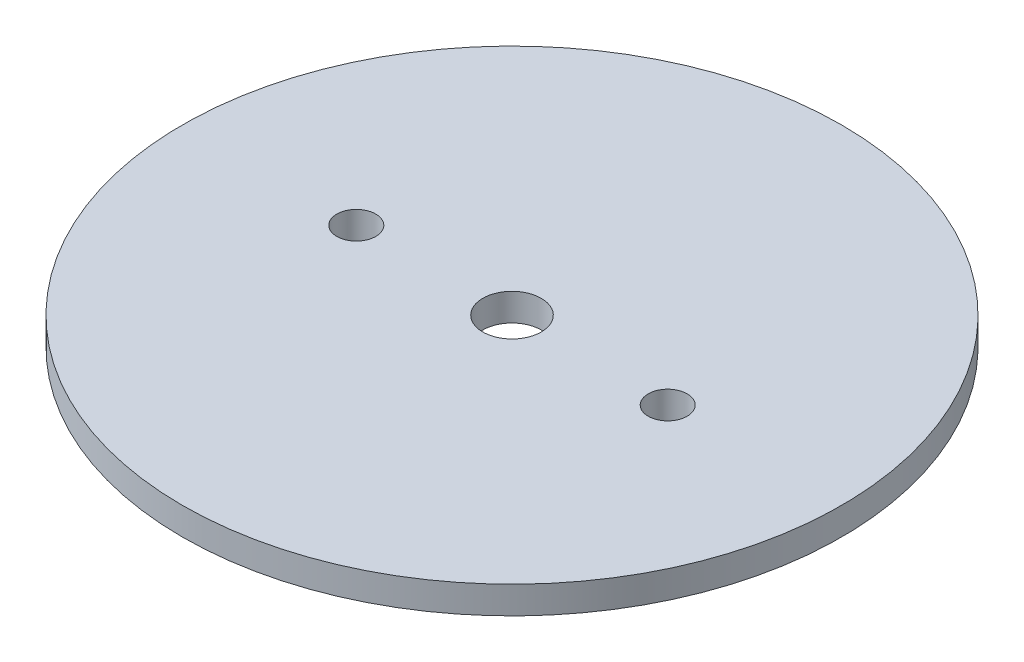
ISO-10303-21;
HEADER;
FILE_DESCRIPTION(('STEP AP214'),'2;1');
FILE_NAME('part.step','',(''),(''),'','','');
FILE_SCHEMA(('AUTOMOTIVE_DESIGN { 1 0 10303 214 1 1 1 1 }'));
ENDSEC;
DATA;
#1=APPLICATION_CONTEXT('core data for automotive mechanical design processes');
#2=APPLICATION_PROTOCOL_DEFINITION('international standard','automotive_design',2000,#1);
#3=PRODUCT_CONTEXT('',#1,'mechanical');
#4=PRODUCT('Part','Part','',(#3));
#5=PRODUCT_RELATED_PRODUCT_CATEGORY('part','',(#4));
#6=PRODUCT_DEFINITION_FORMATION('','',#4);
#7=PRODUCT_DEFINITION_CONTEXT('part definition',#1,'design');
#8=PRODUCT_DEFINITION('design','',#6,#7);
#9=PRODUCT_DEFINITION_SHAPE('','',#8);
#10=(LENGTH_UNIT() NAMED_UNIT(*) SI_UNIT(.MILLI.,.METRE.));
#11=(NAMED_UNIT(*) PLANE_ANGLE_UNIT() SI_UNIT($,.RADIAN.));
#12=(NAMED_UNIT(*) SI_UNIT($,.STERADIAN.) SOLID_ANGLE_UNIT());
#13=UNCERTAINTY_MEASURE_WITH_UNIT(LENGTH_MEASURE(1.E-05),#10,'distance_accuracy_value','');
#14=(GEOMETRIC_REPRESENTATION_CONTEXT(3) GLOBAL_UNCERTAINTY_ASSIGNED_CONTEXT((#13)) GLOBAL_UNIT_ASSIGNED_CONTEXT((#10,
#11,#12)) REPRESENTATION_CONTEXT('',''));
#15=CARTESIAN_POINT('',(0.,0.,0.));
#16=DIRECTION('',(0.,0.,1.));
#17=DIRECTION('',(1.,0.,0.));
#18=AXIS2_PLACEMENT_3D('',#15,#16,#17);
#19=CARTESIAN_POINT('',(0.,1.5875,0.));
#20=DIRECTION('',(0.,-1.,0.));
#21=DIRECTION('',(0.,0.,-1.));
#22=AXIS2_PLACEMENT_3D('',#19,#20,#21);
#23=CYLINDRICAL_SURFACE('',#22,38.1);
#24=CARTESIAN_POINT('',(0.,1.5875,0.));
#25=DIRECTION('',(0.,1.,0.));
#26=DIRECTION('',(0.,0.,1.));
#27=AXIS2_PLACEMENT_3D('',#24,#25,#26);
#28=CIRCLE('',#27,38.1);
#29=CARTESIAN_POINT('',(0.,1.5875,38.1));
#30=VERTEX_POINT('',#29);
#31=EDGE_CURVE('E10',#30,#30,#28,.T.);
#32=ORIENTED_EDGE('',*,*,#31,.F.);
#33=EDGE_LOOP('',(#32));
#34=FACE_BOUND('',#33,.T.);
#35=CARTESIAN_POINT('',(0.,-1.5875,0.));
#36=DIRECTION('',(0.,1.,0.));
#37=DIRECTION('',(0.,0.,1.));
#38=AXIS2_PLACEMENT_3D('',#35,#36,#37);
#39=CIRCLE('',#38,38.1);
#40=CARTESIAN_POINT('',(0.,-1.5875,38.1));
#41=VERTEX_POINT('',#40);
#42=EDGE_CURVE('E44',#41,#41,#39,.T.);
#43=ORIENTED_EDGE('',*,*,#42,.T.);
#44=EDGE_LOOP('',(#43));
#45=FACE_BOUND('',#44,.T.);
#46=ADVANCED_FACE('F41',(#34,#45),#23,.T.);
#47=CARTESIAN_POINT('',(0.,1.5875,0.));
#48=DIRECTION('',(0.,1.,0.));
#49=DIRECTION('',(0.,0.,1.));
#50=AXIS2_PLACEMENT_3D('',#47,#48,#49);
#51=PLANE('',#50);
#52=CARTESIAN_POINT('',(0.,1.58750000000001,0.));
#53=DIRECTION('',(0.,-1.,0.));
#54=DIRECTION('',(0.,0.,-1.));
#55=AXIS2_PLACEMENT_3D('',#52,#53,#54);
#56=CIRCLE('',#55,3.3782);
#57=CARTESIAN_POINT('',(0.,1.58750000000001,-3.3782));
#58=VERTEX_POINT('',#57);
#59=EDGE_CURVE('E70',#58,#58,#56,.T.);
#60=ORIENTED_EDGE('',*,*,#59,.T.);
#61=EDGE_LOOP('',(#60));
#62=FACE_BOUND('',#61,.T.);
#63=CARTESIAN_POINT('',(18.,1.58750000000001,0.));
#64=DIRECTION('',(0.,-1.,0.));
#65=DIRECTION('',(0.,0.,-1.));
#66=AXIS2_PLACEMENT_3D('',#63,#64,#65);
#67=CIRCLE('',#66,2.24999999999998);
#68=CARTESIAN_POINT('',(18.,1.58750000000001,-2.24999999999998));
#69=VERTEX_POINT('',#68);
#70=EDGE_CURVE('E62',#69,#69,#67,.T.);
#71=ORIENTED_EDGE('',*,*,#70,.T.);
#72=EDGE_LOOP('',(#71));
#73=FACE_BOUND('',#72,.T.);
#74=CARTESIAN_POINT('',(-18.,1.58750000000001,0.));
#75=DIRECTION('',(0.,-1.,0.));
#76=DIRECTION('',(0.,0.,-1.));
#77=AXIS2_PLACEMENT_3D('',#74,#75,#76);
#78=CIRCLE('',#77,2.24999999999998);
#79=CARTESIAN_POINT('',(-18.,1.58750000000001,-2.24999999999998));
#80=VERTEX_POINT('',#79);
#81=EDGE_CURVE('E53',#80,#80,#78,.T.);
#82=ORIENTED_EDGE('',*,*,#81,.T.);
#83=EDGE_LOOP('',(#82));
#84=FACE_BOUND('',#83,.T.);
#85=ORIENTED_EDGE('',*,*,#31,.T.);
#86=EDGE_LOOP('',(#85));
#87=FACE_BOUND('',#86,.T.);
#88=ADVANCED_FACE('F79',(#62,#73,#84,#87),#51,.T.);
#89=CARTESIAN_POINT('',(0.,-1.5875,0.));
#90=DIRECTION('',(0.,1.,0.));
#91=DIRECTION('',(0.,0.,1.));
#92=AXIS2_PLACEMENT_3D('',#89,#90,#91);
#93=PLANE('',#92);
#94=CARTESIAN_POINT('',(0.,-1.5875,0.));
#95=DIRECTION('',(0.,-1.,0.));
#96=DIRECTION('',(0.,0.,-1.));
#97=AXIS2_PLACEMENT_3D('',#94,#95,#96);
#98=CIRCLE('',#97,3.3782);
#99=CARTESIAN_POINT('',(0.,-1.5875,-3.3782));
#100=VERTEX_POINT('',#99);
#101=EDGE_CURVE('E71',#100,#100,#98,.T.);
#102=ORIENTED_EDGE('',*,*,#101,.F.);
#103=EDGE_LOOP('',(#102));
#104=FACE_BOUND('',#103,.T.);
#105=CARTESIAN_POINT('',(18.,-1.5875,0.));
#106=DIRECTION('',(0.,-1.,0.));
#107=DIRECTION('',(0.,0.,-1.));
#108=AXIS2_PLACEMENT_3D('',#105,#106,#107);
#109=CIRCLE('',#108,2.24999999999998);
#110=CARTESIAN_POINT('',(18.,-1.5875,-2.24999999999998));
#111=VERTEX_POINT('',#110);
#112=EDGE_CURVE('E66',#111,#111,#109,.T.);
#113=ORIENTED_EDGE('',*,*,#112,.F.);
#114=EDGE_LOOP('',(#113));
#115=FACE_BOUND('',#114,.T.);
#116=CARTESIAN_POINT('',(-18.,-1.5875,0.));
#117=DIRECTION('',(0.,-1.,0.));
#118=DIRECTION('',(0.,0.,-1.));
#119=AXIS2_PLACEMENT_3D('',#116,#117,#118);
#120=CIRCLE('',#119,2.24999999999998);
#121=CARTESIAN_POINT('',(-18.,-1.5875,-2.24999999999998));
#122=VERTEX_POINT('',#121);
#123=EDGE_CURVE('E58',#122,#122,#120,.T.);
#124=ORIENTED_EDGE('',*,*,#123,.F.);
#125=EDGE_LOOP('',(#124));
#126=FACE_BOUND('',#125,.T.);
#127=ORIENTED_EDGE('',*,*,#42,.F.);
#128=EDGE_LOOP('',(#127));
#129=FACE_BOUND('',#128,.T.);
#130=ADVANCED_FACE('F89',(#104,#115,#126,#129),#93,.F.);
#131=CARTESIAN_POINT('',(-18.,-1.5875,0.));
#132=DIRECTION('',(0.,-1.,0.));
#133=DIRECTION('',(0.,0.,-1.));
#134=AXIS2_PLACEMENT_3D('',#131,#132,#133);
#135=CYLINDRICAL_SURFACE('',#134,2.24999999999998);
#136=ORIENTED_EDGE('',*,*,#81,.F.);
#137=EDGE_LOOP('',(#136));
#138=FACE_BOUND('',#137,.T.);
#139=ORIENTED_EDGE('',*,*,#123,.T.);
#140=EDGE_LOOP('',(#139));
#141=FACE_BOUND('',#140,.T.);
#142=ADVANCED_FACE('F92',(#138,#141),#135,.F.);
#143=CARTESIAN_POINT('',(18.,-1.5875,0.));
#144=DIRECTION('',(0.,-1.,0.));
#145=DIRECTION('',(0.,0.,-1.));
#146=AXIS2_PLACEMENT_3D('',#143,#144,#145);
#147=CYLINDRICAL_SURFACE('',#146,2.24999999999998);
#148=ORIENTED_EDGE('',*,*,#70,.F.);
#149=EDGE_LOOP('',(#148));
#150=FACE_BOUND('',#149,.T.);
#151=ORIENTED_EDGE('',*,*,#112,.T.);
#152=EDGE_LOOP('',(#151));
#153=FACE_BOUND('',#152,.T.);
#154=ADVANCED_FACE('F85',(#150,#153),#147,.F.);
#155=CARTESIAN_POINT('',(0.,1.58750000000001,0.));
#156=DIRECTION('',(0.,-1.,0.));
#157=DIRECTION('',(0.,0.,-1.));
#158=AXIS2_PLACEMENT_3D('',#155,#156,#157);
#159=CYLINDRICAL_SURFACE('',#158,3.3782);
#160=ORIENTED_EDGE('',*,*,#59,.F.);
#161=EDGE_LOOP('',(#160));
#162=FACE_BOUND('',#161,.T.);
#163=ORIENTED_EDGE('',*,*,#101,.T.);
#164=EDGE_LOOP('',(#163));
#165=FACE_BOUND('',#164,.T.);
#166=ADVANCED_FACE('F82',(#162,#165),#159,.F.);
#167=CLOSED_SHELL('',(#46,#88,#130,#142,#154,#166));
#168=MANIFOLD_SOLID_BREP('B2',#167);
#169=ADVANCED_BREP_SHAPE_REPRESENTATION('',(#18,#168),#14);
#170=SHAPE_DEFINITION_REPRESENTATION(#9,#169);
ENDSEC;
END-ISO-10303-21;
